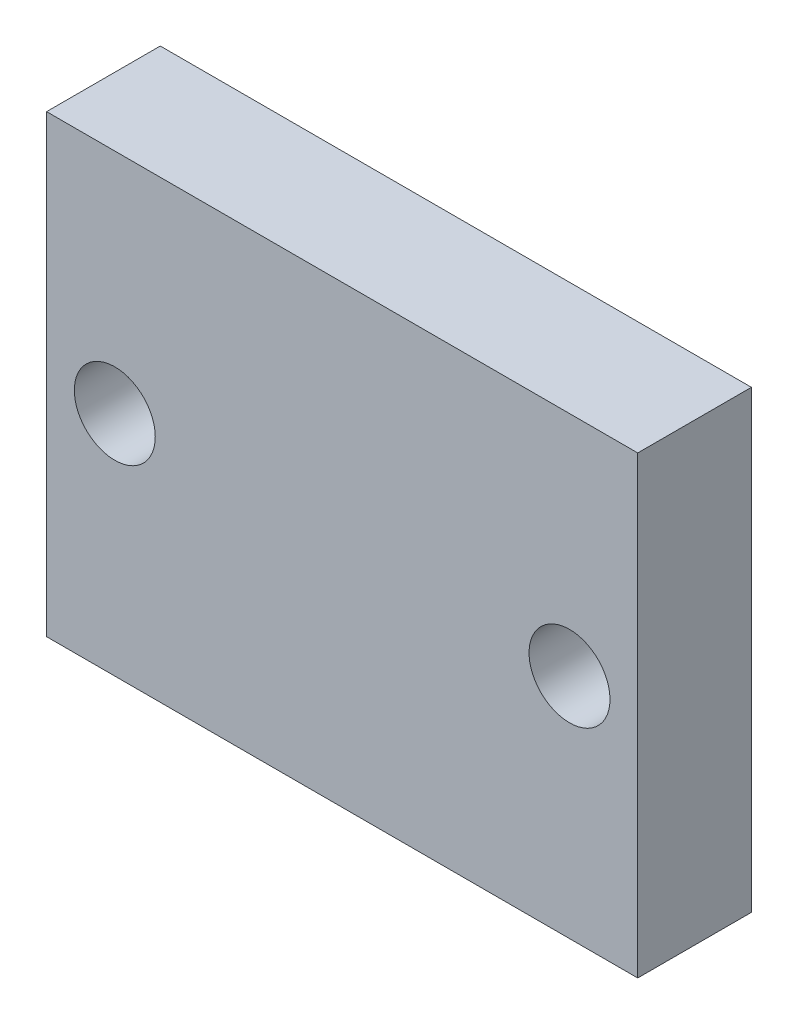
ISO-10303-21;
HEADER;
FILE_DESCRIPTION(('STEP AP214'),'2;1');
FILE_NAME('part.step','',(''),(''),'','','');
FILE_SCHEMA(('AUTOMOTIVE_DESIGN { 1 0 10303 214 1 1 1 1 }'));
ENDSEC;
DATA;
#1=APPLICATION_CONTEXT('core data for automotive mechanical design processes');
#2=APPLICATION_PROTOCOL_DEFINITION('international standard','automotive_design',2000,#1);
#3=PRODUCT_CONTEXT('',#1,'mechanical');
#4=PRODUCT('Part','Part','',(#3));
#5=PRODUCT_RELATED_PRODUCT_CATEGORY('part','',(#4));
#6=PRODUCT_DEFINITION_FORMATION('','',#4);
#7=PRODUCT_DEFINITION_CONTEXT('part definition',#1,'design');
#8=PRODUCT_DEFINITION('design','',#6,#7);
#9=PRODUCT_DEFINITION_SHAPE('','',#8);
#10=(LENGTH_UNIT() NAMED_UNIT(*) SI_UNIT(.MILLI.,.METRE.));
#11=(NAMED_UNIT(*) PLANE_ANGLE_UNIT() SI_UNIT($,.RADIAN.));
#12=(NAMED_UNIT(*) SI_UNIT($,.STERADIAN.) SOLID_ANGLE_UNIT());
#13=UNCERTAINTY_MEASURE_WITH_UNIT(LENGTH_MEASURE(1.E-05),#10,'distance_accuracy_value','');
#14=(GEOMETRIC_REPRESENTATION_CONTEXT(3) GLOBAL_UNCERTAINTY_ASSIGNED_CONTEXT((#13)) GLOBAL_UNIT_ASSIGNED_CONTEXT((#10,
#11,#12)) REPRESENTATION_CONTEXT('',''));
#15=CARTESIAN_POINT('',(0.,0.,0.));
#16=DIRECTION('',(0.,0.,1.));
#17=DIRECTION('',(1.,0.,0.));
#18=AXIS2_PLACEMENT_3D('',#15,#16,#17);
#19=CARTESIAN_POINT('',(0.,0.,3.175));
#20=DIRECTION('',(1.,0.,0.));
#21=DIRECTION('',(0.,0.,-1.));
#22=AXIS2_PLACEMENT_3D('',#19,#20,#21);
#23=PLANE('',#22);
#24=DIRECTION('',(0.,-1.,0.));
#25=VECTOR('',#24,1.);
#26=CARTESIAN_POINT('',(0.,0.,0.));
#27=LINE('',#26,#25);
#28=CARTESIAN_POINT('',(0.,12.7,0.));
#29=VERTEX_POINT('',#28);
#30=CARTESIAN_POINT('',(0.,0.,0.));
#31=VERTEX_POINT('',#30);
#32=EDGE_CURVE('E98',#29,#31,#27,.T.);
#33=ORIENTED_EDGE('',*,*,#32,.T.);
#34=DIRECTION('',(0.,0.,-1.));
#35=VECTOR('',#34,1.);
#36=CARTESIAN_POINT('',(0.,0.,3.175));
#37=LINE('',#36,#35);
#38=CARTESIAN_POINT('',(0.,0.,3.175));
#39=VERTEX_POINT('',#38);
#40=EDGE_CURVE('E11',#39,#31,#37,.T.);
#41=ORIENTED_EDGE('',*,*,#40,.F.);
#42=DIRECTION('',(0.,-1.,0.));
#43=VECTOR('',#42,1.);
#44=CARTESIAN_POINT('',(0.,0.,3.175));
#45=LINE('',#44,#43);
#46=CARTESIAN_POINT('',(0.,12.7,3.175));
#47=VERTEX_POINT('',#46);
#48=EDGE_CURVE('E86',#47,#39,#45,.T.);
#49=ORIENTED_EDGE('',*,*,#48,.F.);
#50=DIRECTION('',(0.,0.,-1.));
#51=VECTOR('',#50,1.);
#52=CARTESIAN_POINT('',(0.,12.7,3.175));
#53=LINE('',#52,#51);
#54=EDGE_CURVE('E94',#47,#29,#53,.T.);
#55=ORIENTED_EDGE('',*,*,#54,.T.);
#56=EDGE_LOOP('',(#33,#41,#49,#55));
#57=FACE_BOUND('',#56,.T.);
#58=ADVANCED_FACE('F35',(#57),#23,.F.);
#59=CARTESIAN_POINT('',(0.,0.,3.175));
#60=DIRECTION('',(0.,1.,0.));
#61=DIRECTION('',(0.,0.,1.));
#62=AXIS2_PLACEMENT_3D('',#59,#60,#61);
#63=PLANE('',#62);
#64=DIRECTION('',(1.,0.,0.));
#65=VECTOR('',#64,1.);
#66=CARTESIAN_POINT('',(0.,0.,0.));
#67=LINE('',#66,#65);
#68=CARTESIAN_POINT('',(16.51,0.,0.));
#69=VERTEX_POINT('',#68);
#70=EDGE_CURVE('E90',#31,#69,#67,.T.);
#71=ORIENTED_EDGE('',*,*,#70,.T.);
#72=DIRECTION('',(0.,0.,-1.));
#73=VECTOR('',#72,1.);
#74=CARTESIAN_POINT('',(16.51,0.,3.175));
#75=LINE('',#74,#73);
#76=CARTESIAN_POINT('',(16.51,0.,3.175));
#77=VERTEX_POINT('',#76);
#78=EDGE_CURVE('E43',#77,#69,#75,.T.);
#79=ORIENTED_EDGE('',*,*,#78,.F.);
#80=DIRECTION('',(1.,0.,0.));
#81=VECTOR('',#80,1.);
#82=CARTESIAN_POINT('',(0.,0.,3.175));
#83=LINE('',#82,#81);
#84=EDGE_CURVE('E81',#39,#77,#83,.T.);
#85=ORIENTED_EDGE('',*,*,#84,.F.);
#86=ORIENTED_EDGE('',*,*,#40,.T.);
#87=EDGE_LOOP('',(#71,#79,#85,#86));
#88=FACE_BOUND('',#87,.T.);
#89=ADVANCED_FACE('F89',(#88),#63,.F.);
#90=CARTESIAN_POINT('',(16.51,0.,3.175));
#91=DIRECTION('',(-1.,0.,0.));
#92=DIRECTION('',(0.,0.,1.));
#93=AXIS2_PLACEMENT_3D('',#90,#91,#92);
#94=PLANE('',#93);
#95=DIRECTION('',(0.,1.,0.));
#96=VECTOR('',#95,1.);
#97=CARTESIAN_POINT('',(16.51,0.,0.));
#98=LINE('',#97,#96);
#99=CARTESIAN_POINT('',(16.51,12.7,0.));
#100=VERTEX_POINT('',#99);
#101=EDGE_CURVE('E68',#69,#100,#98,.T.);
#102=ORIENTED_EDGE('',*,*,#101,.T.);
#103=DIRECTION('',(0.,0.,-1.));
#104=VECTOR('',#103,1.);
#105=CARTESIAN_POINT('',(16.51,12.7,3.175));
#106=LINE('',#105,#104);
#107=CARTESIAN_POINT('',(16.51,12.7,3.175));
#108=VERTEX_POINT('',#107);
#109=EDGE_CURVE('E91',#108,#100,#106,.T.);
#110=ORIENTED_EDGE('',*,*,#109,.F.);
#111=DIRECTION('',(0.,1.,0.));
#112=VECTOR('',#111,1.);
#113=CARTESIAN_POINT('',(16.51,0.,3.175));
#114=LINE('',#113,#112);
#115=EDGE_CURVE('E84',#77,#108,#114,.T.);
#116=ORIENTED_EDGE('',*,*,#115,.F.);
#117=ORIENTED_EDGE('',*,*,#78,.T.);
#118=EDGE_LOOP('',(#102,#110,#116,#117));
#119=FACE_BOUND('',#118,.T.);
#120=ADVANCED_FACE('F92',(#119),#94,.F.);
#121=CARTESIAN_POINT('',(0.,12.7,3.175));
#122=DIRECTION('',(0.,-1.,0.));
#123=DIRECTION('',(0.,0.,-1.));
#124=AXIS2_PLACEMENT_3D('',#121,#122,#123);
#125=PLANE('',#124);
#126=DIRECTION('',(-1.,0.,0.));
#127=VECTOR('',#126,1.);
#128=CARTESIAN_POINT('',(0.,12.7,0.));
#129=LINE('',#128,#127);
#130=EDGE_CURVE('E74',#100,#29,#129,.T.);
#131=ORIENTED_EDGE('',*,*,#130,.T.);
#132=ORIENTED_EDGE('',*,*,#54,.F.);
#133=DIRECTION('',(-1.,0.,0.));
#134=VECTOR('',#133,1.);
#135=CARTESIAN_POINT('',(0.,12.7,3.175));
#136=LINE('',#135,#134);
#137=EDGE_CURVE('E51',#108,#47,#136,.T.);
#138=ORIENTED_EDGE('',*,*,#137,.F.);
#139=ORIENTED_EDGE('',*,*,#109,.T.);
#140=EDGE_LOOP('',(#131,#132,#138,#139));
#141=FACE_BOUND('',#140,.T.);
#142=ADVANCED_FACE('F106',(#141),#125,.F.);
#143=CARTESIAN_POINT('',(0.,0.,3.175));
#144=DIRECTION('',(0.,0.,-1.));
#145=DIRECTION('',(-1.,0.,0.));
#146=AXIS2_PLACEMENT_3D('',#143,#144,#145);
#147=PLANE('',#146);
#148=CARTESIAN_POINT('',(1.905,6.35,3.175));
#149=DIRECTION('',(0.,0.,1.));
#150=DIRECTION('',(1.,0.,0.));
#151=AXIS2_PLACEMENT_3D('',#148,#149,#150);
#152=CIRCLE('',#151,1.1303);
#153=CARTESIAN_POINT('',(3.0353,6.35,3.175));
#154=VERTEX_POINT('',#153);
#155=EDGE_CURVE('E118',#154,#154,#152,.T.);
#156=ORIENTED_EDGE('',*,*,#155,.F.);
#157=EDGE_LOOP('',(#156));
#158=FACE_BOUND('',#157,.T.);
#159=CARTESIAN_POINT('',(14.605,6.35,3.175));
#160=DIRECTION('',(0.,0.,1.));
#161=DIRECTION('',(1.,0.,0.));
#162=AXIS2_PLACEMENT_3D('',#159,#160,#161);
#163=CIRCLE('',#162,1.1303);
#164=CARTESIAN_POINT('',(15.7353,6.35,3.175));
#165=VERTEX_POINT('',#164);
#166=EDGE_CURVE('E112',#165,#165,#163,.T.);
#167=ORIENTED_EDGE('',*,*,#166,.F.);
#168=EDGE_LOOP('',(#167));
#169=FACE_BOUND('',#168,.T.);
#170=ORIENTED_EDGE('',*,*,#48,.T.);
#171=ORIENTED_EDGE('',*,*,#84,.T.);
#172=ORIENTED_EDGE('',*,*,#115,.T.);
#173=ORIENTED_EDGE('',*,*,#137,.T.);
#174=EDGE_LOOP('',(#170,#171,#172,#173));
#175=FACE_BOUND('',#174,.T.);
#176=ADVANCED_FACE('F82',(#158,#169,#175),#147,.F.);
#177=CARTESIAN_POINT('',(0.,0.,0.));
#178=DIRECTION('',(0.,0.,-1.));
#179=DIRECTION('',(-1.,0.,0.));
#180=AXIS2_PLACEMENT_3D('',#177,#178,#179);
#181=PLANE('',#180);
#182=CARTESIAN_POINT('',(1.905,6.35,0.));
#183=DIRECTION('',(0.,0.,1.));
#184=DIRECTION('',(1.,0.,0.));
#185=AXIS2_PLACEMENT_3D('',#182,#183,#184);
#186=CIRCLE('',#185,1.1303);
#187=CARTESIAN_POINT('',(3.0353,6.35,0.));
#188=VERTEX_POINT('',#187);
#189=EDGE_CURVE('E101',#188,#188,#186,.T.);
#190=ORIENTED_EDGE('',*,*,#189,.T.);
#191=EDGE_LOOP('',(#190));
#192=FACE_BOUND('',#191,.T.);
#193=CARTESIAN_POINT('',(14.605,6.35,0.));
#194=DIRECTION('',(0.,0.,1.));
#195=DIRECTION('',(1.,0.,0.));
#196=AXIS2_PLACEMENT_3D('',#193,#194,#195);
#197=CIRCLE('',#196,1.1303);
#198=CARTESIAN_POINT('',(15.7353,6.35,0.));
#199=VERTEX_POINT('',#198);
#200=EDGE_CURVE('E115',#199,#199,#197,.T.);
#201=ORIENTED_EDGE('',*,*,#200,.T.);
#202=EDGE_LOOP('',(#201));
#203=FACE_BOUND('',#202,.T.);
#204=ORIENTED_EDGE('',*,*,#32,.F.);
#205=ORIENTED_EDGE('',*,*,#130,.F.);
#206=ORIENTED_EDGE('',*,*,#101,.F.);
#207=ORIENTED_EDGE('',*,*,#70,.F.);
#208=EDGE_LOOP('',(#204,#205,#206,#207));
#209=FACE_BOUND('',#208,.T.);
#210=ADVANCED_FACE('F109',(#192,#203,#209),#181,.T.);
#211=CARTESIAN_POINT('',(14.605,6.35,0.));
#212=DIRECTION('',(0.,0.,1.));
#213=DIRECTION('',(1.,0.,0.));
#214=AXIS2_PLACEMENT_3D('',#211,#212,#213);
#215=CYLINDRICAL_SURFACE('',#214,1.1303);
#216=ORIENTED_EDGE('',*,*,#200,.F.);
#217=EDGE_LOOP('',(#216));
#218=FACE_BOUND('',#217,.T.);
#219=ORIENTED_EDGE('',*,*,#166,.T.);
#220=EDGE_LOOP('',(#219));
#221=FACE_BOUND('',#220,.T.);
#222=ADVANCED_FACE('F129',(#218,#221),#215,.F.);
#223=CARTESIAN_POINT('',(1.905,6.35,0.));
#224=DIRECTION('',(0.,0.,1.));
#225=DIRECTION('',(1.,0.,0.));
#226=AXIS2_PLACEMENT_3D('',#223,#224,#225);
#227=CYLINDRICAL_SURFACE('',#226,1.1303);
#228=ORIENTED_EDGE('',*,*,#189,.F.);
#229=EDGE_LOOP('',(#228));
#230=FACE_BOUND('',#229,.T.);
#231=ORIENTED_EDGE('',*,*,#155,.T.);
#232=EDGE_LOOP('',(#231));
#233=FACE_BOUND('',#232,.T.);
#234=ADVANCED_FACE('F126',(#230,#233),#227,.F.);
#235=CLOSED_SHELL('',(#58,#89,#120,#142,#176,#210,#222,#234));
#236=MANIFOLD_SOLID_BREP('B2',#235);
#237=ADVANCED_BREP_SHAPE_REPRESENTATION('',(#18,#236),#14);
#238=SHAPE_DEFINITION_REPRESENTATION(#9,#237);
ENDSEC;
END-ISO-10303-21;
